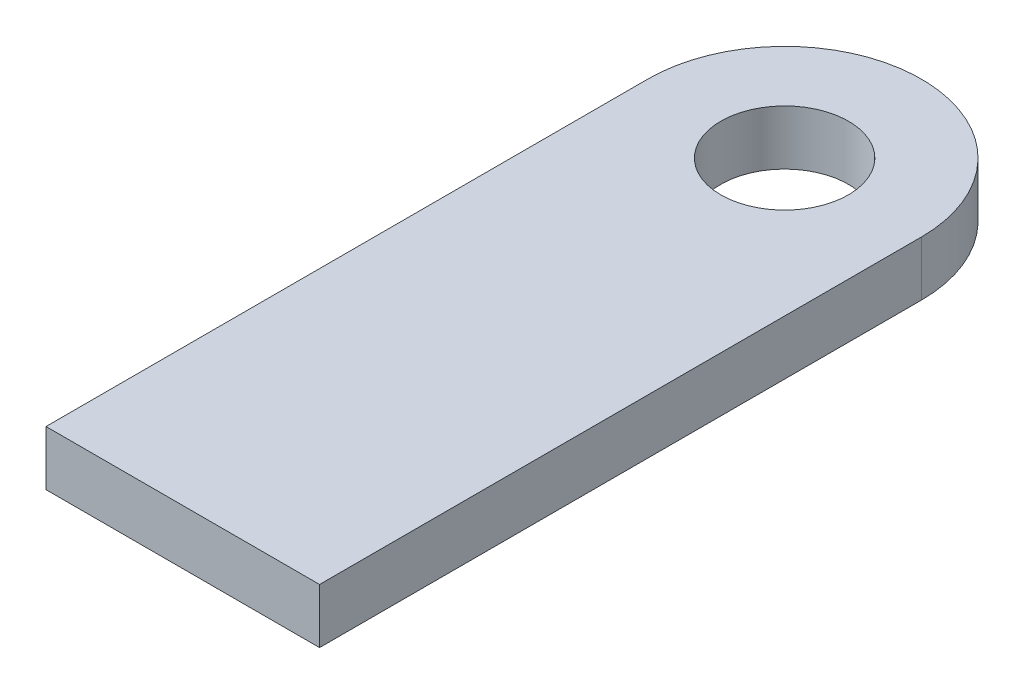
ISO-10303-21;
HEADER;
FILE_DESCRIPTION(('STEP AP214'),'2;1');
FILE_NAME('part.step','',(''),(''),'','','');
FILE_SCHEMA(('AUTOMOTIVE_DESIGN { 1 0 10303 214 1 1 1 1 }'));
ENDSEC;
DATA;
#1=APPLICATION_CONTEXT('core data for automotive mechanical design processes');
#2=APPLICATION_PROTOCOL_DEFINITION('international standard','automotive_design',2000,#1);
#3=PRODUCT_CONTEXT('',#1,'mechanical');
#4=PRODUCT('Part','Part','',(#3));
#5=PRODUCT_RELATED_PRODUCT_CATEGORY('part','',(#4));
#6=PRODUCT_DEFINITION_FORMATION('','',#4);
#7=PRODUCT_DEFINITION_CONTEXT('part definition',#1,'design');
#8=PRODUCT_DEFINITION('design','',#6,#7);
#9=PRODUCT_DEFINITION_SHAPE('','',#8);
#10=(LENGTH_UNIT() NAMED_UNIT(*) SI_UNIT(.MILLI.,.METRE.));
#11=(NAMED_UNIT(*) PLANE_ANGLE_UNIT() SI_UNIT($,.RADIAN.));
#12=(NAMED_UNIT(*) SI_UNIT($,.STERADIAN.) SOLID_ANGLE_UNIT());
#13=UNCERTAINTY_MEASURE_WITH_UNIT(LENGTH_MEASURE(1.E-05),#10,'distance_accuracy_value','');
#14=(GEOMETRIC_REPRESENTATION_CONTEXT(3) GLOBAL_UNCERTAINTY_ASSIGNED_CONTEXT((#13)) GLOBAL_UNIT_ASSIGNED_CONTEXT((#10,
#11,#12)) REPRESENTATION_CONTEXT('',''));
#15=CARTESIAN_POINT('',(0.,0.,0.));
#16=DIRECTION('',(0.,0.,1.));
#17=DIRECTION('',(1.,0.,0.));
#18=AXIS2_PLACEMENT_3D('',#15,#16,#17);
#19=CARTESIAN_POINT('',(-1.21168789764755,3.,-33.1756032514206));
#20=DIRECTION('',(0.,-1.,0.));
#21=DIRECTION('',(0.,0.,-1.));
#22=AXIS2_PLACEMENT_3D('',#19,#20,#21);
#23=PLANE('',#22);
#24=DIRECTION('',(1.,0.,0.));
#25=VECTOR('',#24,1.);
#26=CARTESIAN_POINT('',(6.28831210235246,3.,-0.175603251420631));
#27=LINE('',#26,#25);
#28=CARTESIAN_POINT('',(-8.71168789764754,3.,-0.175603251420629));
#29=VERTEX_POINT('',#28);
#30=CARTESIAN_POINT('',(6.28831210235246,3.,-0.175603251420631));
#31=VERTEX_POINT('',#30);
#32=EDGE_CURVE('E89',#29,#31,#27,.T.);
#33=ORIENTED_EDGE('',*,*,#32,.T.);
#34=DIRECTION('',(0.,0.,-1.));
#35=VECTOR('',#34,1.);
#36=CARTESIAN_POINT('',(6.28831210235245,3.,-33.1756032514206));
#37=LINE('',#36,#35);
#38=CARTESIAN_POINT('',(6.28831210235245,3.,-33.1756032514206));
#39=VERTEX_POINT('',#38);
#40=EDGE_CURVE('E84',#31,#39,#37,.T.);
#41=ORIENTED_EDGE('',*,*,#40,.T.);
#42=CARTESIAN_POINT('',(-1.21168789764755,3.,-33.1756032514206));
#43=DIRECTION('',(0.,1.,0.));
#44=DIRECTION('',(0.,0.,-1.));
#45=AXIS2_PLACEMENT_3D('',#42,#43,#44);
#46=CIRCLE('',#45,7.5);
#47=CARTESIAN_POINT('',(-8.71168789764754,3.,-33.1756032514206));
#48=VERTEX_POINT('',#47);
#49=EDGE_CURVE('E87',#39,#48,#46,.T.);
#50=ORIENTED_EDGE('',*,*,#49,.T.);
#51=DIRECTION('',(0.,0.,1.));
#52=VECTOR('',#51,1.);
#53=CARTESIAN_POINT('',(-8.71168789764754,3.,-0.175603251420629));
#54=LINE('',#53,#52);
#55=EDGE_CURVE('E54',#48,#29,#54,.T.);
#56=ORIENTED_EDGE('',*,*,#55,.T.);
#57=EDGE_LOOP('',(#33,#41,#50,#56));
#58=FACE_BOUND('',#57,.T.);
#59=CARTESIAN_POINT('',(-1.21168789764755,3.,-33.1756032514206));
#60=DIRECTION('',(0.,1.,0.));
#61=DIRECTION('',(0.,0.,1.));
#62=AXIS2_PLACEMENT_3D('',#59,#60,#61);
#63=CIRCLE('',#62,3.5);
#64=CARTESIAN_POINT('',(-1.21168789764755,3.,-29.6756032514206));
#65=VERTEX_POINT('',#64);
#66=EDGE_CURVE('E104',#65,#65,#63,.T.);
#67=ORIENTED_EDGE('',*,*,#66,.F.);
#68=EDGE_LOOP('',(#67));
#69=FACE_BOUND('',#68,.T.);
#70=ADVANCED_FACE('F37',(#58,#69),#23,.F.);
#71=CARTESIAN_POINT('',(-1.21168789764755,0.,-33.1756032514206));
#72=DIRECTION('',(0.,-1.,0.));
#73=DIRECTION('',(0.,0.,-1.));
#74=AXIS2_PLACEMENT_3D('',#71,#72,#73);
#75=PLANE('',#74);
#76=DIRECTION('',(1.,0.,0.));
#77=VECTOR('',#76,1.);
#78=CARTESIAN_POINT('',(6.28831210235246,0.,-0.175603251420631));
#79=LINE('',#78,#77);
#80=CARTESIAN_POINT('',(-8.71168789764754,0.,-0.175603251420629));
#81=VERTEX_POINT('',#80);
#82=CARTESIAN_POINT('',(6.28831210235246,0.,-0.175603251420631));
#83=VERTEX_POINT('',#82);
#84=EDGE_CURVE('E101',#81,#83,#79,.T.);
#85=ORIENTED_EDGE('',*,*,#84,.F.);
#86=DIRECTION('',(0.,0.,1.));
#87=VECTOR('',#86,1.);
#88=CARTESIAN_POINT('',(-8.71168789764754,0.,-0.175603251420629));
#89=LINE('',#88,#87);
#90=CARTESIAN_POINT('',(-8.71168789764754,0.,-33.1756032514206));
#91=VERTEX_POINT('',#90);
#92=EDGE_CURVE('E77',#91,#81,#89,.T.);
#93=ORIENTED_EDGE('',*,*,#92,.F.);
#94=CARTESIAN_POINT('',(-1.21168789764755,0.,-33.1756032514206));
#95=DIRECTION('',(0.,1.,0.));
#96=DIRECTION('',(0.,0.,-1.));
#97=AXIS2_PLACEMENT_3D('',#94,#95,#96);
#98=CIRCLE('',#97,7.5);
#99=CARTESIAN_POINT('',(6.28831210235245,0.,-33.1756032514206));
#100=VERTEX_POINT('',#99);
#101=EDGE_CURVE('E71',#100,#91,#98,.T.);
#102=ORIENTED_EDGE('',*,*,#101,.F.);
#103=DIRECTION('',(0.,0.,-1.));
#104=VECTOR('',#103,1.);
#105=CARTESIAN_POINT('',(6.28831210235245,0.,-33.1756032514206));
#106=LINE('',#105,#104);
#107=EDGE_CURVE('E93',#83,#100,#106,.T.);
#108=ORIENTED_EDGE('',*,*,#107,.F.);
#109=EDGE_LOOP('',(#85,#93,#102,#108));
#110=FACE_BOUND('',#109,.T.);
#111=CARTESIAN_POINT('',(-1.21168789764755,0.,-33.1756032514206));
#112=DIRECTION('',(0.,1.,0.));
#113=DIRECTION('',(0.,0.,1.));
#114=AXIS2_PLACEMENT_3D('',#111,#112,#113);
#115=CIRCLE('',#114,3.5);
#116=CARTESIAN_POINT('',(-1.21168789764755,0.,-29.6756032514206));
#117=VERTEX_POINT('',#116);
#118=EDGE_CURVE('E116',#117,#117,#115,.T.);
#119=ORIENTED_EDGE('',*,*,#118,.T.);
#120=EDGE_LOOP('',(#119));
#121=FACE_BOUND('',#120,.T.);
#122=ADVANCED_FACE('F112',(#110,#121),#75,.T.);
#123=CARTESIAN_POINT('',(6.28831210235246,3.,-0.175603251420631));
#124=DIRECTION('',(0.,0.,-1.));
#125=DIRECTION('',(-1.,0.,0.));
#126=AXIS2_PLACEMENT_3D('',#123,#124,#125);
#127=PLANE('',#126);
#128=ORIENTED_EDGE('',*,*,#84,.T.);
#129=DIRECTION('',(0.,-1.,0.));
#130=VECTOR('',#129,1.);
#131=CARTESIAN_POINT('',(6.28831210235246,3.,-0.175603251420631));
#132=LINE('',#131,#130);
#133=EDGE_CURVE('E11',#31,#83,#132,.T.);
#134=ORIENTED_EDGE('',*,*,#133,.F.);
#135=ORIENTED_EDGE('',*,*,#32,.F.);
#136=DIRECTION('',(0.,-1.,0.));
#137=VECTOR('',#136,1.);
#138=CARTESIAN_POINT('',(-8.71168789764754,3.,-0.175603251420629));
#139=LINE('',#138,#137);
#140=EDGE_CURVE('E97',#29,#81,#139,.T.);
#141=ORIENTED_EDGE('',*,*,#140,.T.);
#142=EDGE_LOOP('',(#128,#134,#135,#141));
#143=FACE_BOUND('',#142,.T.);
#144=ADVANCED_FACE('F39',(#143),#127,.F.);
#145=CARTESIAN_POINT('',(6.28831210235245,3.,-33.1756032514206));
#146=DIRECTION('',(-1.,0.,0.));
#147=DIRECTION('',(0.,0.,1.));
#148=AXIS2_PLACEMENT_3D('',#145,#146,#147);
#149=PLANE('',#148);
#150=ORIENTED_EDGE('',*,*,#107,.T.);
#151=DIRECTION('',(0.,-1.,0.));
#152=VECTOR('',#151,1.);
#153=CARTESIAN_POINT('',(6.28831210235245,3.,-33.1756032514206));
#154=LINE('',#153,#152);
#155=EDGE_CURVE('E46',#39,#100,#154,.T.);
#156=ORIENTED_EDGE('',*,*,#155,.F.);
#157=ORIENTED_EDGE('',*,*,#40,.F.);
#158=ORIENTED_EDGE('',*,*,#133,.T.);
#159=EDGE_LOOP('',(#150,#156,#157,#158));
#160=FACE_BOUND('',#159,.T.);
#161=ADVANCED_FACE('F92',(#160),#149,.F.);
#162=CARTESIAN_POINT('',(-1.21168789764755,3.,-33.1756032514206));
#163=DIRECTION('',(0.,-1.,0.));
#164=DIRECTION('',(0.,0.,-1.));
#165=AXIS2_PLACEMENT_3D('',#162,#163,#164);
#166=CYLINDRICAL_SURFACE('',#165,7.5);
#167=ORIENTED_EDGE('',*,*,#101,.T.);
#168=DIRECTION('',(0.,-1.,0.));
#169=VECTOR('',#168,1.);
#170=CARTESIAN_POINT('',(-8.71168789764754,3.,-33.1756032514206));
#171=LINE('',#170,#169);
#172=EDGE_CURVE('E94',#48,#91,#171,.T.);
#173=ORIENTED_EDGE('',*,*,#172,.F.);
#174=ORIENTED_EDGE('',*,*,#49,.F.);
#175=ORIENTED_EDGE('',*,*,#155,.T.);
#176=EDGE_LOOP('',(#167,#173,#174,#175));
#177=FACE_BOUND('',#176,.T.);
#178=ADVANCED_FACE('F95',(#177),#166,.T.);
#179=CARTESIAN_POINT('',(-8.71168789764754,3.,-0.175603251420629));
#180=DIRECTION('',(1.,0.,0.));
#181=DIRECTION('',(0.,0.,-1.));
#182=AXIS2_PLACEMENT_3D('',#179,#180,#181);
#183=PLANE('',#182);
#184=ORIENTED_EDGE('',*,*,#92,.T.);
#185=ORIENTED_EDGE('',*,*,#140,.F.);
#186=ORIENTED_EDGE('',*,*,#55,.F.);
#187=ORIENTED_EDGE('',*,*,#172,.T.);
#188=EDGE_LOOP('',(#184,#185,#186,#187));
#189=FACE_BOUND('',#188,.T.);
#190=ADVANCED_FACE('F109',(#189),#183,.F.);
#191=CARTESIAN_POINT('',(-1.21168789764755,3.,-33.1756032514206));
#192=DIRECTION('',(0.,-1.,0.));
#193=DIRECTION('',(0.,0.,-1.));
#194=AXIS2_PLACEMENT_3D('',#191,#192,#193);
#195=CYLINDRICAL_SURFACE('',#194,3.5);
#196=ORIENTED_EDGE('',*,*,#66,.T.);
#197=EDGE_LOOP('',(#196));
#198=FACE_BOUND('',#197,.T.);
#199=ORIENTED_EDGE('',*,*,#118,.F.);
#200=EDGE_LOOP('',(#199));
#201=FACE_BOUND('',#200,.T.);
#202=ADVANCED_FACE('F122',(#198,#201),#195,.F.);
#203=CLOSED_SHELL('',(#70,#122,#144,#161,#178,#190,#202));
#204=MANIFOLD_SOLID_BREP('B2',#203);
#205=ADVANCED_BREP_SHAPE_REPRESENTATION('',(#18,#204),#14);
#206=SHAPE_DEFINITION_REPRESENTATION(#9,#205);
ENDSEC;
END-ISO-10303-21;
